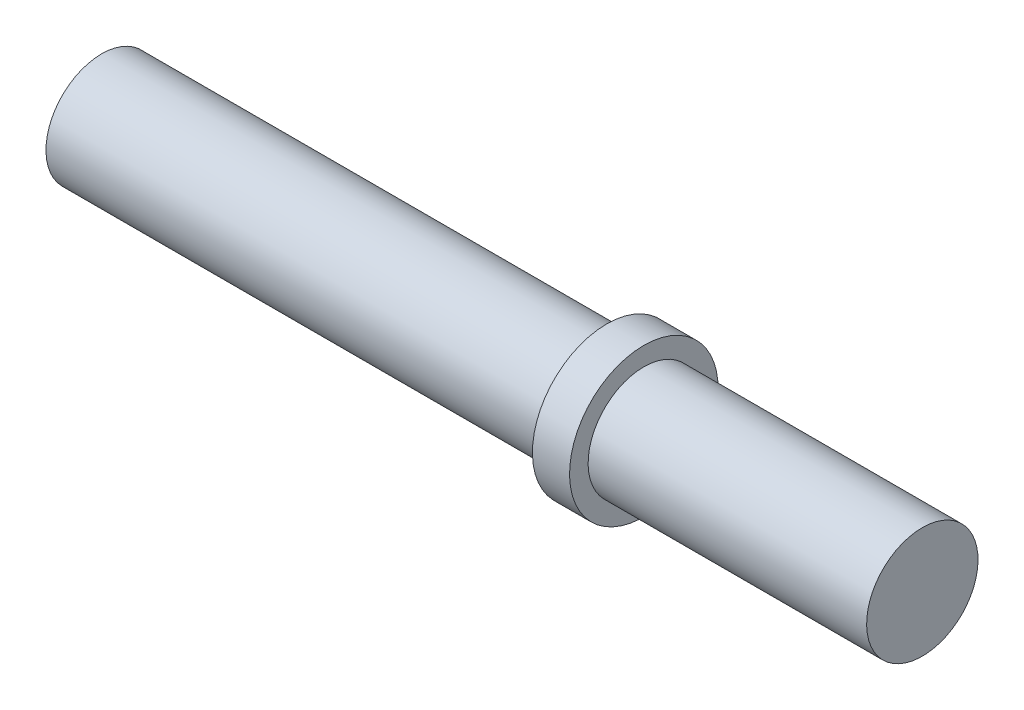
ISO-10303-21;
HEADER;
FILE_DESCRIPTION(('STEP AP214'),'2;1');
FILE_NAME('part.step','',(''),(''),'','','');
FILE_SCHEMA(('AUTOMOTIVE_DESIGN { 1 0 10303 214 1 1 1 1 }'));
ENDSEC;
DATA;
#1=APPLICATION_CONTEXT('core data for automotive mechanical design processes');
#2=APPLICATION_PROTOCOL_DEFINITION('international standard','automotive_design',2000,#1);
#3=PRODUCT_CONTEXT('',#1,'mechanical');
#4=PRODUCT('Part','Part','',(#3));
#5=PRODUCT_RELATED_PRODUCT_CATEGORY('part','',(#4));
#6=PRODUCT_DEFINITION_FORMATION('','',#4);
#7=PRODUCT_DEFINITION_CONTEXT('part definition',#1,'design');
#8=PRODUCT_DEFINITION('design','',#6,#7);
#9=PRODUCT_DEFINITION_SHAPE('','',#8);
#10=(LENGTH_UNIT() NAMED_UNIT(*) SI_UNIT(.MILLI.,.METRE.));
#11=(NAMED_UNIT(*) PLANE_ANGLE_UNIT() SI_UNIT($,.RADIAN.));
#12=(NAMED_UNIT(*) SI_UNIT($,.STERADIAN.) SOLID_ANGLE_UNIT());
#13=UNCERTAINTY_MEASURE_WITH_UNIT(LENGTH_MEASURE(1.E-05),#10,'distance_accuracy_value','');
#14=(GEOMETRIC_REPRESENTATION_CONTEXT(3) GLOBAL_UNCERTAINTY_ASSIGNED_CONTEXT((#13)) GLOBAL_UNIT_ASSIGNED_CONTEXT((#10,
#11,#12)) REPRESENTATION_CONTEXT('',''));
#15=CARTESIAN_POINT('',(0.,0.,0.));
#16=DIRECTION('',(0.,0.,1.));
#17=DIRECTION('',(1.,0.,0.));
#18=AXIS2_PLACEMENT_3D('',#15,#16,#17);
#19=CARTESIAN_POINT('',(0.,3.,0.));
#20=DIRECTION('',(1.,0.,0.));
#21=DIRECTION('',(0.,1.,0.));
#22=AXIS2_PLACEMENT_3D('',#19,#20,#21);
#23=PLANE('',#22);
#24=CARTESIAN_POINT('',(0.,3.,0.));
#25=DIRECTION('',(1.,0.,0.));
#26=DIRECTION('',(0.,1.,0.));
#27=AXIS2_PLACEMENT_3D('',#24,#25,#26);
#28=CIRCLE('',#27,3.);
#29=CARTESIAN_POINT('',(0.,6.,0.));
#30=VERTEX_POINT('',#29);
#31=EDGE_CURVE('E10',#30,#30,#28,.T.);
#32=ORIENTED_EDGE('',*,*,#31,.F.);
#33=EDGE_LOOP('',(#32));
#34=FACE_BOUND('',#33,.T.);
#35=ADVANCED_FACE('F40',(#34),#23,.F.);
#36=CARTESIAN_POINT('',(44.2,3.,0.));
#37=DIRECTION('',(1.,0.,0.));
#38=DIRECTION('',(0.,1.,0.));
#39=AXIS2_PLACEMENT_3D('',#36,#37,#38);
#40=CYLINDRICAL_SURFACE('',#39,3.);
#41=CARTESIAN_POINT('',(27.2,3.,0.));
#42=DIRECTION('',(1.,0.,0.));
#43=DIRECTION('',(0.,1.,0.));
#44=AXIS2_PLACEMENT_3D('',#41,#42,#43);
#45=CIRCLE('',#44,3.);
#46=CARTESIAN_POINT('',(27.2,6.00000000000001,0.));
#47=VERTEX_POINT('',#46);
#48=EDGE_CURVE('E47',#47,#47,#45,.T.);
#49=ORIENTED_EDGE('',*,*,#48,.F.);
#50=EDGE_LOOP('',(#49));
#51=FACE_BOUND('',#50,.T.);
#52=ORIENTED_EDGE('',*,*,#31,.T.);
#53=EDGE_LOOP('',(#52));
#54=FACE_BOUND('',#53,.T.);
#55=ADVANCED_FACE('F94',(#51,#54),#40,.T.);
#56=CARTESIAN_POINT('',(27.2,0.,0.));
#57=DIRECTION('',(1.,0.,0.));
#58=DIRECTION('',(0.,1.,0.));
#59=AXIS2_PLACEMENT_3D('',#56,#57,#58);
#60=PLANE('',#59);
#61=CARTESIAN_POINT('',(27.2,3.,0.));
#62=DIRECTION('',(1.,0.,0.));
#63=DIRECTION('',(0.,1.,0.));
#64=AXIS2_PLACEMENT_3D('',#61,#62,#63);
#65=CIRCLE('',#64,4.);
#66=CARTESIAN_POINT('',(27.2,7.00000000000001,0.));
#67=VERTEX_POINT('',#66);
#68=EDGE_CURVE('E52',#67,#67,#65,.T.);
#69=ORIENTED_EDGE('',*,*,#68,.F.);
#70=EDGE_LOOP('',(#69));
#71=FACE_BOUND('',#70,.T.);
#72=ORIENTED_EDGE('',*,*,#48,.T.);
#73=EDGE_LOOP('',(#72));
#74=FACE_BOUND('',#73,.T.);
#75=ADVANCED_FACE('F89',(#71,#74),#60,.F.);
#76=CARTESIAN_POINT('',(44.2,3.,0.));
#77=DIRECTION('',(1.,0.,0.));
#78=DIRECTION('',(0.,1.,0.));
#79=AXIS2_PLACEMENT_3D('',#76,#77,#78);
#80=CYLINDRICAL_SURFACE('',#79,4.);
#81=CARTESIAN_POINT('',(29.2,3.,0.));
#82=DIRECTION('',(1.,0.,0.));
#83=DIRECTION('',(0.,1.,0.));
#84=AXIS2_PLACEMENT_3D('',#81,#82,#83);
#85=CIRCLE('',#84,4.);
#86=CARTESIAN_POINT('',(29.2,7.00000000000001,0.));
#87=VERTEX_POINT('',#86);
#88=EDGE_CURVE('E57',#87,#87,#85,.T.);
#89=ORIENTED_EDGE('',*,*,#88,.F.);
#90=EDGE_LOOP('',(#89));
#91=FACE_BOUND('',#90,.T.);
#92=ORIENTED_EDGE('',*,*,#68,.T.);
#93=EDGE_LOOP('',(#92));
#94=FACE_BOUND('',#93,.T.);
#95=ADVANCED_FACE('F83',(#91,#94),#80,.T.);
#96=CARTESIAN_POINT('',(29.2,-1.,0.));
#97=DIRECTION('',(-1.,0.,0.));
#98=DIRECTION('',(0.,-1.,0.));
#99=AXIS2_PLACEMENT_3D('',#96,#97,#98);
#100=PLANE('',#99);
#101=CARTESIAN_POINT('',(29.2,3.,0.));
#102=DIRECTION('',(1.,0.,0.));
#103=DIRECTION('',(0.,1.,0.));
#104=AXIS2_PLACEMENT_3D('',#101,#102,#103);
#105=CIRCLE('',#104,3.);
#106=CARTESIAN_POINT('',(29.2,6.00000000000001,0.));
#107=VERTEX_POINT('',#106);
#108=EDGE_CURVE('E63',#107,#107,#105,.T.);
#109=ORIENTED_EDGE('',*,*,#108,.F.);
#110=EDGE_LOOP('',(#109));
#111=FACE_BOUND('',#110,.T.);
#112=ORIENTED_EDGE('',*,*,#88,.T.);
#113=EDGE_LOOP('',(#112));
#114=FACE_BOUND('',#113,.T.);
#115=ADVANCED_FACE('F77',(#111,#114),#100,.F.);
#116=CARTESIAN_POINT('',(44.2,3.,0.));
#117=DIRECTION('',(1.,0.,0.));
#118=DIRECTION('',(0.,1.,0.));
#119=AXIS2_PLACEMENT_3D('',#116,#117,#118);
#120=CYLINDRICAL_SURFACE('',#119,3.);
#121=CARTESIAN_POINT('',(44.2,3.,0.));
#122=DIRECTION('',(1.,0.,0.));
#123=DIRECTION('',(0.,1.,0.));
#124=AXIS2_PLACEMENT_3D('',#121,#122,#123);
#125=CIRCLE('',#124,3.);
#126=CARTESIAN_POINT('',(44.2,6.00000000000001,0.));
#127=VERTEX_POINT('',#126);
#128=EDGE_CURVE('E67',#127,#127,#125,.T.);
#129=ORIENTED_EDGE('',*,*,#128,.F.);
#130=EDGE_LOOP('',(#129));
#131=FACE_BOUND('',#130,.T.);
#132=ORIENTED_EDGE('',*,*,#108,.T.);
#133=EDGE_LOOP('',(#132));
#134=FACE_BOUND('',#133,.T.);
#135=ADVANCED_FACE('F74',(#131,#134),#120,.T.);
#136=CARTESIAN_POINT('',(44.2,0.,0.));
#137=DIRECTION('',(-1.,0.,0.));
#138=DIRECTION('',(0.,-1.,0.));
#139=AXIS2_PLACEMENT_3D('',#136,#137,#138);
#140=PLANE('',#139);
#141=ORIENTED_EDGE('',*,*,#128,.T.);
#142=EDGE_LOOP('',(#141));
#143=FACE_BOUND('',#142,.T.);
#144=ADVANCED_FACE('F72',(#143),#140,.F.);
#145=CLOSED_SHELL('',(#35,#55,#75,#95,#115,#135,#144));
#146=MANIFOLD_SOLID_BREP('B2',#145);
#147=ADVANCED_BREP_SHAPE_REPRESENTATION('',(#18,#146),#14);
#148=SHAPE_DEFINITION_REPRESENTATION(#9,#147);
ENDSEC;
END-ISO-10303-21;
